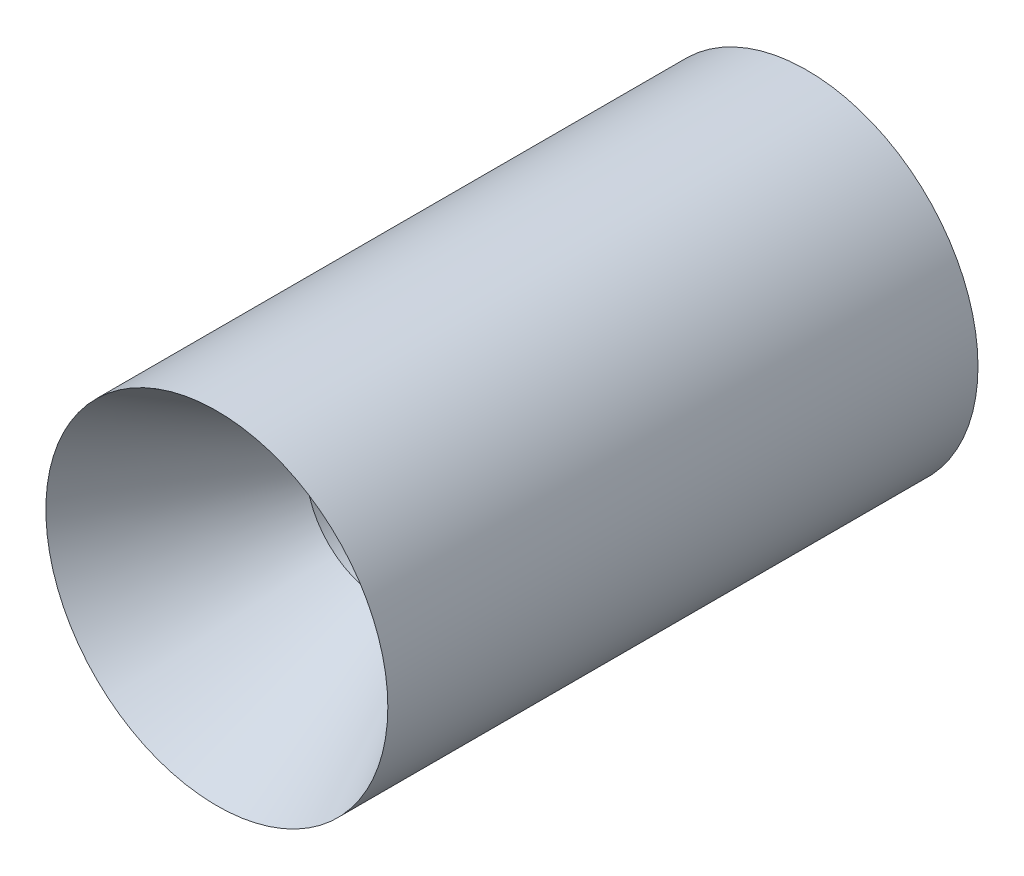
ISO-10303-21;
HEADER;
FILE_DESCRIPTION(('STEP AP214'),'2;1');
FILE_NAME('part.step','',(''),(''),'','','');
FILE_SCHEMA(('AUTOMOTIVE_DESIGN { 1 0 10303 214 1 1 1 1 }'));
ENDSEC;
DATA;
#1=APPLICATION_CONTEXT('core data for automotive mechanical design processes');
#2=APPLICATION_PROTOCOL_DEFINITION('international standard','automotive_design',2000,#1);
#3=PRODUCT_CONTEXT('',#1,'mechanical');
#4=PRODUCT('Part','Part','',(#3));
#5=PRODUCT_RELATED_PRODUCT_CATEGORY('part','',(#4));
#6=PRODUCT_DEFINITION_FORMATION('','',#4);
#7=PRODUCT_DEFINITION_CONTEXT('part definition',#1,'design');
#8=PRODUCT_DEFINITION('design','',#6,#7);
#9=PRODUCT_DEFINITION_SHAPE('','',#8);
#10=(LENGTH_UNIT() NAMED_UNIT(*) SI_UNIT(.MILLI.,.METRE.));
#11=(NAMED_UNIT(*) PLANE_ANGLE_UNIT() SI_UNIT($,.RADIAN.));
#12=(NAMED_UNIT(*) SI_UNIT($,.STERADIAN.) SOLID_ANGLE_UNIT());
#13=UNCERTAINTY_MEASURE_WITH_UNIT(LENGTH_MEASURE(1.E-05),#10,'distance_accuracy_value','');
#14=(GEOMETRIC_REPRESENTATION_CONTEXT(3) GLOBAL_UNCERTAINTY_ASSIGNED_CONTEXT((#13)) GLOBAL_UNIT_ASSIGNED_CONTEXT((#10,
#11,#12)) REPRESENTATION_CONTEXT('',''));
#15=CARTESIAN_POINT('',(0.,0.,0.));
#16=DIRECTION('',(0.,0.,1.));
#17=DIRECTION('',(1.,0.,0.));
#18=AXIS2_PLACEMENT_3D('',#15,#16,#17);
#19=CARTESIAN_POINT('',(0.,0.,0.));
#20=DIRECTION('',(0.,0.,1.));
#21=DIRECTION('',(1.,0.,0.));
#22=AXIS2_PLACEMENT_3D('',#19,#20,#21);
#23=CONICAL_SURFACE('',#22,14.351,0.5235987755983);
#24=CARTESIAN_POINT('',(0.,0.,-13.8581385113585));
#25=DIRECTION('',(0.,0.,1.));
#26=DIRECTION('',(1.,0.,0.));
#27=AXIS2_PLACEMENT_3D('',#24,#25,#26);
#28=CIRCLE('',#27,6.35);
#29=CARTESIAN_POINT('',(6.35,0.,-13.8581385113585));
#30=VERTEX_POINT('',#29);
#31=EDGE_CURVE('E10',#30,#30,#28,.T.);
#32=ORIENTED_EDGE('',*,*,#31,.F.);
#33=EDGE_LOOP('',(#32));
#34=FACE_BOUND('',#33,.T.);
#35=CARTESIAN_POINT('',(0.,0.,0.));
#36=DIRECTION('',(0.,0.,1.));
#37=DIRECTION('',(1.,0.,0.));
#38=AXIS2_PLACEMENT_3D('',#35,#36,#37);
#39=CIRCLE('',#38,14.351);
#40=CARTESIAN_POINT('',(14.351,0.,0.));
#41=VERTEX_POINT('',#40);
#42=EDGE_CURVE('E51',#41,#41,#39,.T.);
#43=ORIENTED_EDGE('',*,*,#42,.T.);
#44=EDGE_LOOP('',(#43));
#45=FACE_BOUND('',#44,.T.);
#46=ADVANCED_FACE('F32',(#34,#45),#23,.F.);
#47=CARTESIAN_POINT('',(0.,0.,0.));
#48=DIRECTION('',(0.,0.,1.));
#49=DIRECTION('',(1.,0.,0.));
#50=AXIS2_PLACEMENT_3D('',#47,#48,#49);
#51=CYLINDRICAL_SURFACE('',#50,6.35);
#52=CARTESIAN_POINT('',(0.,0.,-19.5576107688917));
#53=DIRECTION('',(0.,0.,1.));
#54=DIRECTION('',(1.,0.,0.));
#55=AXIS2_PLACEMENT_3D('',#52,#53,#54);
#56=CIRCLE('',#55,6.35);
#57=CARTESIAN_POINT('',(6.35,0.,-19.5576107688917));
#58=VERTEX_POINT('',#57);
#59=EDGE_CURVE('E38',#58,#58,#56,.T.);
#60=ORIENTED_EDGE('',*,*,#59,.F.);
#61=EDGE_LOOP('',(#60));
#62=FACE_BOUND('',#61,.T.);
#63=ORIENTED_EDGE('',*,*,#31,.T.);
#64=EDGE_LOOP('',(#63));
#65=FACE_BOUND('',#64,.T.);
#66=ADVANCED_FACE('F70',(#62,#65),#51,.F.);
#67=CARTESIAN_POINT('',(0.,0.,-19.5576107688917));
#68=DIRECTION('',(0.,0.,-1.));
#69=DIRECTION('',(-1.,0.,0.));
#70=AXIS2_PLACEMENT_3D('',#67,#68,#69);
#71=CONICAL_SURFACE('',#70,6.35,0.20943951023932);
#72=CARTESIAN_POINT('',(0.,0.,-49.53));
#73=DIRECTION('',(0.,0.,1.));
#74=DIRECTION('',(1.,0.,0.));
#75=AXIS2_PLACEMENT_3D('',#72,#73,#74);
#76=CIRCLE('',#75,12.720828);
#77=CARTESIAN_POINT('',(12.720828,0.,-49.53));
#78=VERTEX_POINT('',#77);
#79=EDGE_CURVE('E42',#78,#78,#76,.T.);
#80=ORIENTED_EDGE('',*,*,#79,.F.);
#81=EDGE_LOOP('',(#80));
#82=FACE_BOUND('',#81,.T.);
#83=ORIENTED_EDGE('',*,*,#59,.T.);
#84=EDGE_LOOP('',(#83));
#85=FACE_BOUND('',#84,.T.);
#86=ADVANCED_FACE('F65',(#82,#85),#71,.F.);
#87=CARTESIAN_POINT('',(0.,12.720828,-49.53));
#88=DIRECTION('',(0.,0.,1.));
#89=DIRECTION('',(1.,0.,0.));
#90=AXIS2_PLACEMENT_3D('',#87,#88,#89);
#91=PLANE('',#90);
#92=CARTESIAN_POINT('',(0.,0.,-49.53));
#93=DIRECTION('',(0.,0.,1.));
#94=DIRECTION('',(1.,0.,0.));
#95=AXIS2_PLACEMENT_3D('',#92,#93,#94);
#96=CIRCLE('',#95,14.351);
#97=CARTESIAN_POINT('',(14.351,0.,-49.53));
#98=VERTEX_POINT('',#97);
#99=EDGE_CURVE('E46',#98,#98,#96,.T.);
#100=ORIENTED_EDGE('',*,*,#99,.F.);
#101=EDGE_LOOP('',(#100));
#102=FACE_BOUND('',#101,.T.);
#103=ORIENTED_EDGE('',*,*,#79,.T.);
#104=EDGE_LOOP('',(#103));
#105=FACE_BOUND('',#104,.T.);
#106=ADVANCED_FACE('F59',(#102,#105),#91,.F.);
#107=CARTESIAN_POINT('',(0.,0.,0.));
#108=DIRECTION('',(0.,0.,1.));
#109=DIRECTION('',(1.,0.,0.));
#110=AXIS2_PLACEMENT_3D('',#107,#108,#109);
#111=CYLINDRICAL_SURFACE('',#110,14.351);
#112=ORIENTED_EDGE('',*,*,#42,.F.);
#113=EDGE_LOOP('',(#112));
#114=FACE_BOUND('',#113,.T.);
#115=ORIENTED_EDGE('',*,*,#99,.T.);
#116=EDGE_LOOP('',(#115));
#117=FACE_BOUND('',#116,.T.);
#118=ADVANCED_FACE('F56',(#114,#117),#111,.T.);
#119=CLOSED_SHELL('',(#46,#66,#86,#106,#118));
#120=MANIFOLD_SOLID_BREP('B2',#119);
#121=ADVANCED_BREP_SHAPE_REPRESENTATION('',(#18,#120),#14);
#122=SHAPE_DEFINITION_REPRESENTATION(#9,#121);
ENDSEC;
END-ISO-10303-21;
